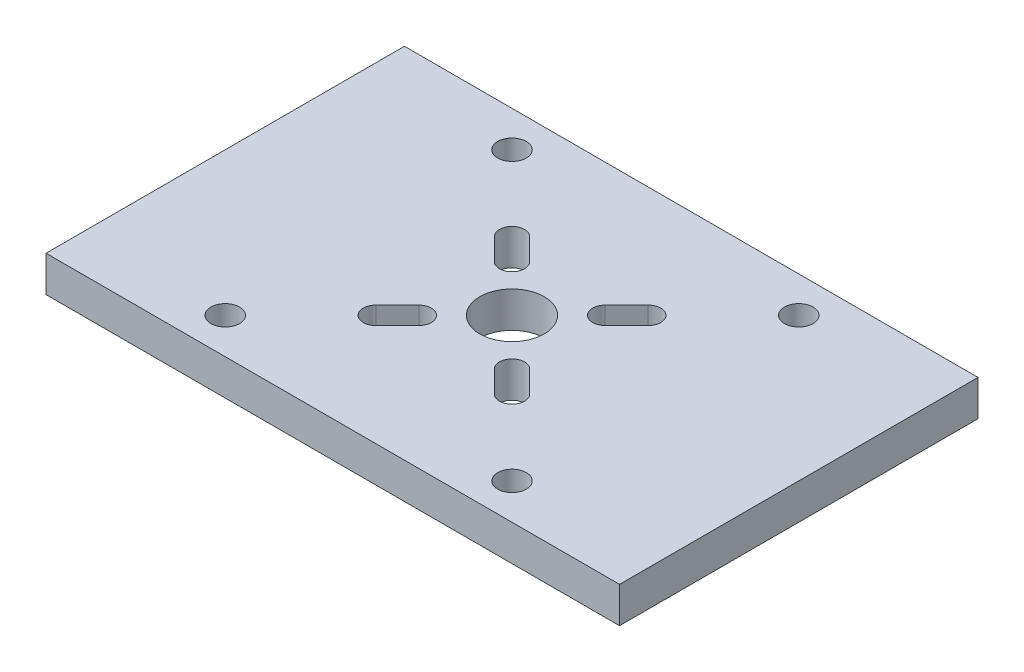
ISO-10303-21;
HEADER;
FILE_DESCRIPTION(('STEP AP214'),'2;1');
FILE_NAME('part.step','',(''),(''),'','','');
FILE_SCHEMA(('AUTOMOTIVE_DESIGN { 1 0 10303 214 1 1 1 1 }'));
ENDSEC;
DATA;
#1=APPLICATION_CONTEXT('core data for automotive mechanical design processes');
#2=APPLICATION_PROTOCOL_DEFINITION('international standard','automotive_design',2000,#1);
#3=PRODUCT_CONTEXT('',#1,'mechanical');
#4=PRODUCT('Part','Part','',(#3));
#5=PRODUCT_RELATED_PRODUCT_CATEGORY('part','',(#4));
#6=PRODUCT_DEFINITION_FORMATION('','',#4);
#7=PRODUCT_DEFINITION_CONTEXT('part definition',#1,'design');
#8=PRODUCT_DEFINITION('design','',#6,#7);
#9=PRODUCT_DEFINITION_SHAPE('','',#8);
#10=(LENGTH_UNIT() NAMED_UNIT(*) SI_UNIT(.MILLI.,.METRE.));
#11=(NAMED_UNIT(*) PLANE_ANGLE_UNIT() SI_UNIT($,.RADIAN.));
#12=(NAMED_UNIT(*) SI_UNIT($,.STERADIAN.) SOLID_ANGLE_UNIT());
#13=UNCERTAINTY_MEASURE_WITH_UNIT(LENGTH_MEASURE(1.E-05),#10,'distance_accuracy_value','');
#14=(GEOMETRIC_REPRESENTATION_CONTEXT(3) GLOBAL_UNCERTAINTY_ASSIGNED_CONTEXT((#13)) GLOBAL_UNIT_ASSIGNED_CONTEXT((#10,
#11,#12)) REPRESENTATION_CONTEXT('',''));
#15=CARTESIAN_POINT('',(0.,0.,0.));
#16=DIRECTION('',(0.,0.,1.));
#17=DIRECTION('',(1.,0.,0.));
#18=AXIS2_PLACEMENT_3D('',#15,#16,#17);
#19=CARTESIAN_POINT('',(0.,0.,0.));
#20=DIRECTION('',(0.,-1.,0.));
#21=DIRECTION('',(0.,0.,-1.));
#22=AXIS2_PLACEMENT_3D('',#19,#20,#21);
#23=PLANE('',#22);
#24=CARTESIAN_POINT('',(-40.,0.,-40.));
#25=DIRECTION('',(0.,-1.,0.));
#26=DIRECTION('',(0.,0.,-1.));
#27=AXIS2_PLACEMENT_3D('',#24,#25,#26);
#28=CIRCLE('',#27,4.);
#29=CARTESIAN_POINT('',(-40.,0.,-44.));
#30=VERTEX_POINT('',#29);
#31=EDGE_CURVE('E799',#30,#30,#28,.T.);
#32=ORIENTED_EDGE('',*,*,#31,.F.);
#33=EDGE_LOOP('',(#32));
#34=FACE_BOUND('',#33,.T.);
#35=CARTESIAN_POINT('',(40.,0.,-40.));
#36=DIRECTION('',(0.,-1.,0.));
#37=DIRECTION('',(0.,0.,-1.));
#38=AXIS2_PLACEMENT_3D('',#35,#36,#37);
#39=CIRCLE('',#38,4.);
#40=CARTESIAN_POINT('',(40.,0.,-44.));
#41=VERTEX_POINT('',#40);
#42=EDGE_CURVE('E803',#41,#41,#39,.T.);
#43=ORIENTED_EDGE('',*,*,#42,.F.);
#44=EDGE_LOOP('',(#43));
#45=FACE_BOUND('',#44,.T.);
#46=CARTESIAN_POINT('',(40.,0.,40.));
#47=DIRECTION('',(0.,-1.,0.));
#48=DIRECTION('',(0.,0.,-1.));
#49=AXIS2_PLACEMENT_3D('',#46,#47,#48);
#50=CIRCLE('',#49,4.);
#51=CARTESIAN_POINT('',(40.,0.,36.));
#52=VERTEX_POINT('',#51);
#53=EDGE_CURVE('E821',#52,#52,#50,.T.);
#54=ORIENTED_EDGE('',*,*,#53,.F.);
#55=EDGE_LOOP('',(#54));
#56=FACE_BOUND('',#55,.T.);
#57=CARTESIAN_POINT('',(-40.,0.,40.));
#58=DIRECTION('',(0.,-1.,0.));
#59=DIRECTION('',(0.,0.,-1.));
#60=AXIS2_PLACEMENT_3D('',#57,#58,#59);
#61=CIRCLE('',#60,4.);
#62=CARTESIAN_POINT('',(-40.,0.,36.));
#63=VERTEX_POINT('',#62);
#64=EDGE_CURVE('E810',#63,#63,#61,.T.);
#65=ORIENTED_EDGE('',*,*,#64,.F.);
#66=EDGE_LOOP('',(#65));
#67=FACE_BOUND('',#66,.T.);
#68=DIRECTION('',(0.707106781186549,0.,0.707106781186546));
#69=VECTOR('',#68,1.);
#70=CARTESIAN_POINT('',(-4.24264068711925,0.,4.24264068711926));
#71=LINE('',#70,#69);
#72=CARTESIAN_POINT('',(-23.2426406871193,0.,-14.7573593128807));
#73=VERTEX_POINT('',#72);
#74=CARTESIAN_POINT('',(-17.2426406871193,0.,-8.75735931288071));
#75=VERTEX_POINT('',#74);
#76=EDGE_CURVE('E497',#73,#75,#71,.T.);
#77=ORIENTED_EDGE('',*,*,#76,.T.);
#78=CARTESIAN_POINT('',(-13.,0.,-13.));
#79=DIRECTION('',(0.,-1.,0.));
#80=DIRECTION('',(0.,0.,-1.));
#81=AXIS2_PLACEMENT_3D('',#78,#79,#80);
#82=CIRCLE('',#81,6.);
#83=CARTESIAN_POINT('',(-8.75735931288069,0.,-17.2426406871193));
#84=VERTEX_POINT('',#83);
#85=EDGE_CURVE('E501',#75,#84,#82,.F.);
#86=ORIENTED_EDGE('',*,*,#85,.T.);
#87=DIRECTION('',(-0.707106781186548,0.,-0.707106781186548));
#88=VECTOR('',#87,1.);
#89=CARTESIAN_POINT('',(4.2426406871193,0.,-4.2426406871193));
#90=LINE('',#89,#88);
#91=CARTESIAN_POINT('',(-14.7573593128807,0.,-23.2426406871193));
#92=VERTEX_POINT('',#91);
#93=EDGE_CURVE('E489',#84,#92,#90,.T.);
#94=ORIENTED_EDGE('',*,*,#93,.T.);
#95=CARTESIAN_POINT('',(-19.,0.,-19.));
#96=DIRECTION('',(0.,-1.,0.));
#97=DIRECTION('',(0.,0.,-1.));
#98=AXIS2_PLACEMENT_3D('',#95,#96,#97);
#99=CIRCLE('',#98,6.00000000000001);
#100=EDGE_CURVE('E493',#92,#73,#99,.F.);
#101=ORIENTED_EDGE('',*,*,#100,.T.);
#102=EDGE_LOOP('',(#77,#86,#94,#101));
#103=FACE_BOUND('',#102,.T.);
#104=DIRECTION('',(0.707106781186548,0.,0.707106781186547));
#105=VECTOR('',#104,1.);
#106=CARTESIAN_POINT('',(-4.24264068711931,0.,4.24264068711931));
#107=LINE('',#106,#105);
#108=CARTESIAN_POINT('',(8.75735931288068,0.,17.2426406871193));
#109=VERTEX_POINT('',#108);
#110=CARTESIAN_POINT('',(14.7573593128807,0.,23.2426406871193));
#111=VERTEX_POINT('',#110);
#112=EDGE_CURVE('E467',#109,#111,#107,.T.);
#113=ORIENTED_EDGE('',*,*,#112,.T.);
#114=CARTESIAN_POINT('',(19.,0.,19.));
#115=DIRECTION('',(0.,-1.,0.));
#116=DIRECTION('',(0.,0.,-1.));
#117=AXIS2_PLACEMENT_3D('',#114,#115,#116);
#118=CIRCLE('',#117,6.);
#119=CARTESIAN_POINT('',(23.2426406871193,0.,14.7573593128807));
#120=VERTEX_POINT('',#119);
#121=EDGE_CURVE('E471',#111,#120,#118,.F.);
#122=ORIENTED_EDGE('',*,*,#121,.T.);
#123=DIRECTION('',(-0.707106781186548,0.,-0.707106781186548));
#124=VECTOR('',#123,1.);
#125=CARTESIAN_POINT('',(4.24264068711927,0.,-4.24264068711927));
#126=LINE('',#125,#124);
#127=CARTESIAN_POINT('',(17.2426406871193,0.,8.75735931288072));
#128=VERTEX_POINT('',#127);
#129=EDGE_CURVE('E447',#120,#128,#126,.T.);
#130=ORIENTED_EDGE('',*,*,#129,.T.);
#131=CARTESIAN_POINT('',(13.,0.,13.));
#132=DIRECTION('',(0.,-1.,0.));
#133=DIRECTION('',(0.,0.,-1.));
#134=AXIS2_PLACEMENT_3D('',#131,#132,#133);
#135=CIRCLE('',#134,6.00000000000001);
#136=EDGE_CURVE('E463',#128,#109,#135,.F.);
#137=ORIENTED_EDGE('',*,*,#136,.T.);
#138=EDGE_LOOP('',(#113,#122,#130,#137));
#139=FACE_BOUND('',#138,.T.);
#140=CARTESIAN_POINT('',(0.,0.,0.));
#141=DIRECTION('',(0.,-1.,0.));
#142=DIRECTION('',(0.,0.,-1.));
#143=AXIS2_PLACEMENT_3D('',#140,#141,#142);
#144=CIRCLE('',#143,9.);
#145=CARTESIAN_POINT('',(0.,0.,-9.));
#146=VERTEX_POINT('',#145);
#147=EDGE_CURVE('E413',#146,#146,#144,.T.);
#148=ORIENTED_EDGE('',*,*,#147,.F.);
#149=EDGE_LOOP('',(#148));
#150=FACE_BOUND('',#149,.T.);
#151=DIRECTION('',(0.,0.,1.));
#152=VECTOR('',#151,1.);
#153=CARTESIAN_POINT('',(80.,0.,-50.));
#154=LINE('',#153,#152);
#155=CARTESIAN_POINT('',(80.,0.,-50.));
#156=VERTEX_POINT('',#155);
#157=CARTESIAN_POINT('',(80.,0.,50.));
#158=VERTEX_POINT('',#157);
#159=EDGE_CURVE('E430',#156,#158,#154,.T.);
#160=ORIENTED_EDGE('',*,*,#159,.T.);
#161=DIRECTION('',(-1.,0.,0.));
#162=VECTOR('',#161,1.);
#163=CARTESIAN_POINT('',(80.,0.,50.));
#164=LINE('',#163,#162);
#165=CARTESIAN_POINT('',(-80.,0.,50.));
#166=VERTEX_POINT('',#165);
#167=EDGE_CURVE('E434',#158,#166,#164,.T.);
#168=ORIENTED_EDGE('',*,*,#167,.T.);
#169=DIRECTION('',(0.,0.,1.));
#170=VECTOR('',#169,1.);
#171=CARTESIAN_POINT('',(-80.,0.,-50.));
#172=LINE('',#171,#170);
#173=CARTESIAN_POINT('',(-80.,0.,-50.));
#174=VERTEX_POINT('',#173);
#175=EDGE_CURVE('E438',#174,#166,#172,.T.);
#176=ORIENTED_EDGE('',*,*,#175,.F.);
#177=DIRECTION('',(-1.,0.,0.));
#178=VECTOR('',#177,1.);
#179=CARTESIAN_POINT('',(80.,0.,-50.));
#180=LINE('',#179,#178);
#181=EDGE_CURVE('E419',#156,#174,#180,.T.);
#182=ORIENTED_EDGE('',*,*,#181,.F.);
#183=EDGE_LOOP('',(#160,#168,#176,#182));
#184=FACE_BOUND('',#183,.T.);
#185=DIRECTION('',(0.707106781186548,0.,-0.707106781186547));
#186=VECTOR('',#185,1.);
#187=CARTESIAN_POINT('',(4.24264068711932,0.,4.24264068711933));
#188=LINE('',#187,#186);
#189=CARTESIAN_POINT('',(-14.7573593128807,0.,23.2426406871193));
#190=VERTEX_POINT('',#189);
#191=CARTESIAN_POINT('',(-8.75735931288068,0.,17.2426406871193));
#192=VERTEX_POINT('',#191);
#193=EDGE_CURVE('E482',#190,#192,#188,.T.);
#194=ORIENTED_EDGE('',*,*,#193,.T.);
#195=CARTESIAN_POINT('',(-13.,0.,13.));
#196=DIRECTION('',(0.,-1.,0.));
#197=DIRECTION('',(0.,0.,-1.));
#198=AXIS2_PLACEMENT_3D('',#195,#196,#197);
#199=CIRCLE('',#198,6.00000000000001);
#200=CARTESIAN_POINT('',(-17.2426406871193,0.,8.75735931288071));
#201=VERTEX_POINT('',#200);
#202=EDGE_CURVE('E486',#192,#201,#199,.F.);
#203=ORIENTED_EDGE('',*,*,#202,.T.);
#204=DIRECTION('',(-0.707106781186547,0.,0.707106781186548));
#205=VECTOR('',#204,1.);
#206=CARTESIAN_POINT('',(-4.24264068711928,0.,-4.24264068711928));
#207=LINE('',#206,#205);
#208=CARTESIAN_POINT('',(-23.2426406871193,0.,14.7573593128807));
#209=VERTEX_POINT('',#208);
#210=EDGE_CURVE('E474',#201,#209,#207,.T.);
#211=ORIENTED_EDGE('',*,*,#210,.T.);
#212=CARTESIAN_POINT('',(-19.,0.,19.));
#213=DIRECTION('',(0.,-1.,0.));
#214=DIRECTION('',(0.,0.,-1.));
#215=AXIS2_PLACEMENT_3D('',#212,#213,#214);
#216=CIRCLE('',#215,6.);
#217=EDGE_CURVE('E478',#209,#190,#216,.F.);
#218=ORIENTED_EDGE('',*,*,#217,.T.);
#219=EDGE_LOOP('',(#194,#203,#211,#218));
#220=FACE_BOUND('',#219,.T.);
#221=DIRECTION('',(0.707106781186548,0.,-0.707106781186547));
#222=VECTOR('',#221,1.);
#223=CARTESIAN_POINT('',(4.24264068711927,0.,4.24264068711927));
#224=LINE('',#223,#222);
#225=CARTESIAN_POINT('',(17.2426406871193,0.,-8.75735931288072));
#226=VERTEX_POINT('',#225);
#227=CARTESIAN_POINT('',(23.2426406871193,0.,-14.7573593128807));
#228=VERTEX_POINT('',#227);
#229=EDGE_CURVE('E52',#226,#228,#224,.T.);
#230=ORIENTED_EDGE('',*,*,#229,.T.);
#231=CARTESIAN_POINT('',(19.,0.,-19.));
#232=DIRECTION('',(0.,-1.,0.));
#233=DIRECTION('',(0.,0.,-1.));
#234=AXIS2_PLACEMENT_3D('',#231,#232,#233);
#235=CIRCLE('',#234,6.00000000000001);
#236=CARTESIAN_POINT('',(14.7573593128807,0.,-23.2426406871193));
#237=VERTEX_POINT('',#236);
#238=EDGE_CURVE('E11',#228,#237,#235,.F.);
#239=ORIENTED_EDGE('',*,*,#238,.T.);
#240=DIRECTION('',(-0.707106781186547,0.,0.707106781186548));
#241=VECTOR('',#240,1.);
#242=CARTESIAN_POINT('',(-4.2426406871193,0.,-4.2426406871193));
#243=LINE('',#242,#241);
#244=CARTESIAN_POINT('',(8.75735931288068,0.,-17.2426406871193));
#245=VERTEX_POINT('',#244);
#246=EDGE_CURVE('E504',#237,#245,#243,.T.);
#247=ORIENTED_EDGE('',*,*,#246,.T.);
#248=CARTESIAN_POINT('',(13.,0.,-13.));
#249=DIRECTION('',(0.,-1.,0.));
#250=DIRECTION('',(0.,0.,-1.));
#251=AXIS2_PLACEMENT_3D('',#248,#249,#250);
#252=CIRCLE('',#251,6.00000000000001);
#253=EDGE_CURVE('E508',#245,#226,#252,.F.);
#254=ORIENTED_EDGE('',*,*,#253,.T.);
#255=EDGE_LOOP('',(#230,#239,#247,#254));
#256=FACE_BOUND('',#255,.T.);
#257=ADVANCED_FACE('F43',(#34,#45,#56,#67,#103,#139,#150,#184,#220,#256),#23,.T.);
#258=ORIENTED_EDGE('',*,*,#238,.F.);
#259=ORIENTED_EDGE('',*,*,#229,.F.);
#260=ORIENTED_EDGE('',*,*,#253,.F.);
#261=ORIENTED_EDGE('',*,*,#246,.F.);
#262=EDGE_LOOP('',(#258,#259,#260,#261));
#263=FACE_BOUND('',#262,.T.);
#264=CARTESIAN_POINT('',(19.,0.,-19.));
#265=DIRECTION('',(0.,-1.,0.));
#266=DIRECTION('',(0.,0.,-1.));
#267=AXIS2_PLACEMENT_3D('',#264,#265,#266);
#268=CIRCLE('',#267,3.50000000000001);
#269=CARTESIAN_POINT('',(21.4748737341529,0.,-16.5251262658471));
#270=VERTEX_POINT('',#269);
#271=CARTESIAN_POINT('',(16.5251262658471,0.,-21.4748737341529));
#272=VERTEX_POINT('',#271);
#273=EDGE_CURVE('E286',#270,#272,#268,.F.);
#274=ORIENTED_EDGE('',*,*,#273,.T.);
#275=DIRECTION('',(-0.707106781186547,0.,0.707106781186548));
#276=VECTOR('',#275,1.);
#277=CARTESIAN_POINT('',(16.5251262658471,0.,-21.4748737341529));
#278=LINE('',#277,#276);
#279=CARTESIAN_POINT('',(10.5251262658471,0.,-15.4748737341529));
#280=VERTEX_POINT('',#279);
#281=EDGE_CURVE('E309',#272,#280,#278,.T.);
#282=ORIENTED_EDGE('',*,*,#281,.T.);
#283=CARTESIAN_POINT('',(13.,0.,-13.));
#284=DIRECTION('',(0.,-1.,0.));
#285=DIRECTION('',(0.,0.,-1.));
#286=AXIS2_PLACEMENT_3D('',#283,#284,#285);
#287=CIRCLE('',#286,3.5);
#288=CARTESIAN_POINT('',(15.4748737341529,0.,-10.5251262658471));
#289=VERTEX_POINT('',#288);
#290=EDGE_CURVE('E277',#280,#289,#287,.F.);
#291=ORIENTED_EDGE('',*,*,#290,.T.);
#292=DIRECTION('',(0.707106781186547,0.,-0.707106781186548));
#293=VECTOR('',#292,1.);
#294=CARTESIAN_POINT('',(21.4748737341529,0.,-16.5251262658471));
#295=LINE('',#294,#293);
#296=EDGE_CURVE('E281',#289,#270,#295,.T.);
#297=ORIENTED_EDGE('',*,*,#296,.T.);
#298=EDGE_LOOP('',(#274,#282,#291,#297));
#299=FACE_BOUND('',#298,.T.);
#300=ADVANCED_FACE('F513',(#263,#299),#23,.T.);
#301=ORIENTED_EDGE('',*,*,#85,.F.);
#302=ORIENTED_EDGE('',*,*,#76,.F.);
#303=ORIENTED_EDGE('',*,*,#100,.F.);
#304=ORIENTED_EDGE('',*,*,#93,.F.);
#305=EDGE_LOOP('',(#301,#302,#303,#304));
#306=FACE_BOUND('',#305,.T.);
#307=CARTESIAN_POINT('',(-19.,0.,-19.));
#308=DIRECTION('',(0.,-1.,0.));
#309=DIRECTION('',(0.,0.,-1.));
#310=AXIS2_PLACEMENT_3D('',#307,#308,#309);
#311=CIRCLE('',#310,3.50000000000001);
#312=CARTESIAN_POINT('',(-16.5251262658471,0.,-21.4748737341529));
#313=VERTEX_POINT('',#312);
#314=CARTESIAN_POINT('',(-21.4748737341529,0.,-16.5251262658471));
#315=VERTEX_POINT('',#314);
#316=EDGE_CURVE('E331',#313,#315,#311,.F.);
#317=ORIENTED_EDGE('',*,*,#316,.T.);
#318=DIRECTION('',(0.707106781186547,0.,0.707106781186548));
#319=VECTOR('',#318,1.);
#320=CARTESIAN_POINT('',(-21.4748737341529,0.,-16.5251262658471));
#321=LINE('',#320,#319);
#322=CARTESIAN_POINT('',(-15.4748737341529,0.,-10.5251262658471));
#323=VERTEX_POINT('',#322);
#324=EDGE_CURVE('E282',#315,#323,#321,.T.);
#325=ORIENTED_EDGE('',*,*,#324,.T.);
#326=CARTESIAN_POINT('',(-13.,0.,-13.));
#327=DIRECTION('',(0.,-1.,0.));
#328=DIRECTION('',(0.,0.,-1.));
#329=AXIS2_PLACEMENT_3D('',#326,#327,#328);
#330=CIRCLE('',#329,3.5);
#331=CARTESIAN_POINT('',(-10.5251262658471,0.,-15.4748737341529));
#332=VERTEX_POINT('',#331);
#333=EDGE_CURVE('E322',#323,#332,#330,.F.);
#334=ORIENTED_EDGE('',*,*,#333,.T.);
#335=DIRECTION('',(-0.707106781186547,0.,-0.707106781186548));
#336=VECTOR('',#335,1.);
#337=CARTESIAN_POINT('',(-16.5251262658471,0.,-21.4748737341529));
#338=LINE('',#337,#336);
#339=EDGE_CURVE('E326',#332,#313,#338,.T.);
#340=ORIENTED_EDGE('',*,*,#339,.T.);
#341=EDGE_LOOP('',(#317,#325,#334,#340));
#342=FACE_BOUND('',#341,.T.);
#343=ADVANCED_FACE('F516',(#306,#342),#23,.T.);
#344=ORIENTED_EDGE('',*,*,#202,.F.);
#345=ORIENTED_EDGE('',*,*,#193,.F.);
#346=ORIENTED_EDGE('',*,*,#217,.F.);
#347=ORIENTED_EDGE('',*,*,#210,.F.);
#348=EDGE_LOOP('',(#344,#345,#346,#347));
#349=FACE_BOUND('',#348,.T.);
#350=CARTESIAN_POINT('',(-19.,0.,19.));
#351=DIRECTION('',(0.,-1.,0.));
#352=DIRECTION('',(0.,0.,-1.));
#353=AXIS2_PLACEMENT_3D('',#350,#351,#352);
#354=CIRCLE('',#353,3.50000000000001);
#355=CARTESIAN_POINT('',(-21.4748737341529,0.,16.5251262658471));
#356=VERTEX_POINT('',#355);
#357=CARTESIAN_POINT('',(-16.5251262658471,0.,21.4748737341529));
#358=VERTEX_POINT('',#357);
#359=EDGE_CURVE('E373',#356,#358,#354,.F.);
#360=ORIENTED_EDGE('',*,*,#359,.T.);
#361=DIRECTION('',(0.707106781186547,0.,-0.707106781186548));
#362=VECTOR('',#361,1.);
#363=CARTESIAN_POINT('',(-16.5251262658471,0.,21.4748737341529));
#364=LINE('',#363,#362);
#365=CARTESIAN_POINT('',(-10.5251262658471,0.,15.4748737341529));
#366=VERTEX_POINT('',#365);
#367=EDGE_CURVE('E396',#358,#366,#364,.T.);
#368=ORIENTED_EDGE('',*,*,#367,.T.);
#369=CARTESIAN_POINT('',(-13.,0.,13.));
#370=DIRECTION('',(0.,-1.,0.));
#371=DIRECTION('',(0.,0.,-1.));
#372=AXIS2_PLACEMENT_3D('',#369,#370,#371);
#373=CIRCLE('',#372,3.5);
#374=CARTESIAN_POINT('',(-15.4748737341529,0.,10.5251262658471));
#375=VERTEX_POINT('',#374);
#376=EDGE_CURVE('E236',#366,#375,#373,.F.);
#377=ORIENTED_EDGE('',*,*,#376,.T.);
#378=DIRECTION('',(-0.707106781186547,0.,0.707106781186548));
#379=VECTOR('',#378,1.);
#380=CARTESIAN_POINT('',(-21.4748737341529,0.,16.5251262658471));
#381=LINE('',#380,#379);
#382=EDGE_CURVE('E369',#375,#356,#381,.T.);
#383=ORIENTED_EDGE('',*,*,#382,.T.);
#384=EDGE_LOOP('',(#360,#368,#377,#383));
#385=FACE_BOUND('',#384,.T.);
#386=ADVANCED_FACE('F559',(#349,#385),#23,.T.);
#387=CARTESIAN_POINT('',(80.,10.,-50.));
#388=DIRECTION('',(1.,0.,0.));
#389=DIRECTION('',(0.,0.,-1.));
#390=AXIS2_PLACEMENT_3D('',#387,#388,#389);
#391=PLANE('',#390);
#392=ORIENTED_EDGE('',*,*,#159,.F.);
#393=DIRECTION('',(0.,-1.,0.));
#394=VECTOR('',#393,1.);
#395=CARTESIAN_POINT('',(80.,10.,-50.));
#396=LINE('',#395,#394);
#397=CARTESIAN_POINT('',(80.,10.,-50.));
#398=VERTEX_POINT('',#397);
#399=EDGE_CURVE('E444',#398,#156,#396,.T.);
#400=ORIENTED_EDGE('',*,*,#399,.F.);
#401=DIRECTION('',(0.,0.,1.));
#402=VECTOR('',#401,1.);
#403=CARTESIAN_POINT('',(80.,10.,-50.));
#404=LINE('',#403,#402);
#405=CARTESIAN_POINT('',(80.,10.,50.));
#406=VERTEX_POINT('',#405);
#407=EDGE_CURVE('E414',#398,#406,#404,.T.);
#408=ORIENTED_EDGE('',*,*,#407,.T.);
#409=DIRECTION('',(0.,-1.,0.));
#410=VECTOR('',#409,1.);
#411=CARTESIAN_POINT('',(80.,10.,50.));
#412=LINE('',#411,#410);
#413=EDGE_CURVE('E429',#406,#158,#412,.T.);
#414=ORIENTED_EDGE('',*,*,#413,.T.);
#415=EDGE_LOOP('',(#392,#400,#408,#414));
#416=FACE_BOUND('',#415,.T.);
#417=ADVANCED_FACE('F45',(#416),#391,.T.);
#418=CARTESIAN_POINT('',(80.,10.,-50.));
#419=DIRECTION('',(0.,0.,1.));
#420=DIRECTION('',(1.,0.,0.));
#421=AXIS2_PLACEMENT_3D('',#418,#419,#420);
#422=PLANE('',#421);
#423=ORIENTED_EDGE('',*,*,#181,.T.);
#424=DIRECTION('',(0.,-1.,0.));
#425=VECTOR('',#424,1.);
#426=CARTESIAN_POINT('',(-80.,10.,-50.));
#427=LINE('',#426,#425);
#428=CARTESIAN_POINT('',(-80.,10.,-50.));
#429=VERTEX_POINT('',#428);
#430=EDGE_CURVE('E448',#429,#174,#427,.T.);
#431=ORIENTED_EDGE('',*,*,#430,.F.);
#432=DIRECTION('',(-1.,0.,0.));
#433=VECTOR('',#432,1.);
#434=CARTESIAN_POINT('',(80.,10.,-50.));
#435=LINE('',#434,#433);
#436=EDGE_CURVE('E426',#398,#429,#435,.T.);
#437=ORIENTED_EDGE('',*,*,#436,.F.);
#438=ORIENTED_EDGE('',*,*,#399,.T.);
#439=EDGE_LOOP('',(#423,#431,#437,#438));
#440=FACE_BOUND('',#439,.T.);
#441=ADVANCED_FACE('F574',(#440),#422,.F.);
#442=CARTESIAN_POINT('',(-80.,10.,-50.));
#443=DIRECTION('',(1.,0.,0.));
#444=DIRECTION('',(0.,0.,-1.));
#445=AXIS2_PLACEMENT_3D('',#442,#443,#444);
#446=PLANE('',#445);
#447=ORIENTED_EDGE('',*,*,#175,.T.);
#448=DIRECTION('',(0.,-1.,0.));
#449=VECTOR('',#448,1.);
#450=CARTESIAN_POINT('',(-80.,10.,50.));
#451=LINE('',#450,#449);
#452=CARTESIAN_POINT('',(-80.,10.,50.));
#453=VERTEX_POINT('',#452);
#454=EDGE_CURVE('E452',#453,#166,#451,.T.);
#455=ORIENTED_EDGE('',*,*,#454,.F.);
#456=DIRECTION('',(0.,0.,1.));
#457=VECTOR('',#456,1.);
#458=CARTESIAN_POINT('',(-80.,10.,-50.));
#459=LINE('',#458,#457);
#460=EDGE_CURVE('E423',#429,#453,#459,.T.);
#461=ORIENTED_EDGE('',*,*,#460,.F.);
#462=ORIENTED_EDGE('',*,*,#430,.T.);
#463=EDGE_LOOP('',(#447,#455,#461,#462));
#464=FACE_BOUND('',#463,.T.);
#465=ADVANCED_FACE('F854',(#464),#446,.F.);
#466=CARTESIAN_POINT('',(80.,10.,50.));
#467=DIRECTION('',(0.,0.,1.));
#468=DIRECTION('',(1.,0.,0.));
#469=AXIS2_PLACEMENT_3D('',#466,#467,#468);
#470=PLANE('',#469);
#471=ORIENTED_EDGE('',*,*,#167,.F.);
#472=ORIENTED_EDGE('',*,*,#413,.F.);
#473=DIRECTION('',(-1.,0.,0.));
#474=VECTOR('',#473,1.);
#475=CARTESIAN_POINT('',(80.,10.,50.));
#476=LINE('',#475,#474);
#477=EDGE_CURVE('E418',#406,#453,#476,.T.);
#478=ORIENTED_EDGE('',*,*,#477,.T.);
#479=ORIENTED_EDGE('',*,*,#454,.T.);
#480=EDGE_LOOP('',(#471,#472,#478,#479));
#481=FACE_BOUND('',#480,.T.);
#482=ADVANCED_FACE('F566',(#481),#470,.T.);
#483=CARTESIAN_POINT('',(0.,10.,0.));
#484=DIRECTION('',(0.,-1.,0.));
#485=DIRECTION('',(0.,0.,-1.));
#486=AXIS2_PLACEMENT_3D('',#483,#484,#485);
#487=PLANE('',#486);
#488=CARTESIAN_POINT('',(-40.,10.,-40.));
#489=DIRECTION('',(0.,-1.,0.));
#490=DIRECTION('',(0.,0.,-1.));
#491=AXIS2_PLACEMENT_3D('',#488,#489,#490);
#492=CIRCLE('',#491,4.);
#493=CARTESIAN_POINT('',(-40.,10.,-44.));
#494=VERTEX_POINT('',#493);
#495=EDGE_CURVE('E797',#494,#494,#492,.T.);
#496=ORIENTED_EDGE('',*,*,#495,.T.);
#497=EDGE_LOOP('',(#496));
#498=FACE_BOUND('',#497,.T.);
#499=CARTESIAN_POINT('',(40.,10.,-40.));
#500=DIRECTION('',(0.,-1.,0.));
#501=DIRECTION('',(0.,0.,-1.));
#502=AXIS2_PLACEMENT_3D('',#499,#500,#501);
#503=CIRCLE('',#502,4.);
#504=CARTESIAN_POINT('',(40.,10.,-44.));
#505=VERTEX_POINT('',#504);
#506=EDGE_CURVE('E825',#505,#505,#503,.T.);
#507=ORIENTED_EDGE('',*,*,#506,.T.);
#508=EDGE_LOOP('',(#507));
#509=FACE_BOUND('',#508,.T.);
#510=CARTESIAN_POINT('',(40.,10.,40.));
#511=DIRECTION('',(0.,-1.,0.));
#512=DIRECTION('',(0.,0.,-1.));
#513=AXIS2_PLACEMENT_3D('',#510,#511,#512);
#514=CIRCLE('',#513,4.);
#515=CARTESIAN_POINT('',(40.,10.,36.));
#516=VERTEX_POINT('',#515);
#517=EDGE_CURVE('E813',#516,#516,#514,.T.);
#518=ORIENTED_EDGE('',*,*,#517,.T.);
#519=EDGE_LOOP('',(#518));
#520=FACE_BOUND('',#519,.T.);
#521=CARTESIAN_POINT('',(-40.,10.,40.));
#522=DIRECTION('',(0.,-1.,0.));
#523=DIRECTION('',(0.,0.,-1.));
#524=AXIS2_PLACEMENT_3D('',#521,#522,#523);
#525=CIRCLE('',#524,4.);
#526=CARTESIAN_POINT('',(-40.,10.,36.));
#527=VERTEX_POINT('',#526);
#528=EDGE_CURVE('E327',#527,#527,#525,.T.);
#529=ORIENTED_EDGE('',*,*,#528,.T.);
#530=EDGE_LOOP('',(#529));
#531=FACE_BOUND('',#530,.T.);
#532=DIRECTION('',(0.707106781186547,0.,0.707106781186548));
#533=VECTOR('',#532,1.);
#534=CARTESIAN_POINT('',(-21.4748737341529,10.,-16.5251262658471));
#535=LINE('',#534,#533);
#536=CARTESIAN_POINT('',(-21.4748737341529,10.,-16.5251262658471));
#537=VERTEX_POINT('',#536);
#538=CARTESIAN_POINT('',(-15.4748737341529,10.,-10.5251262658471));
#539=VERTEX_POINT('',#538);
#540=EDGE_CURVE('E338',#537,#539,#535,.T.);
#541=ORIENTED_EDGE('',*,*,#540,.F.);
#542=CARTESIAN_POINT('',(-19.,10.,-19.));
#543=DIRECTION('',(0.,1.,0.));
#544=DIRECTION('',(0.,0.,-1.));
#545=AXIS2_PLACEMENT_3D('',#542,#543,#544);
#546=CIRCLE('',#545,3.50000000000001);
#547=CARTESIAN_POINT('',(-16.5251262658471,10.,-21.4748737341529));
#548=VERTEX_POINT('',#547);
#549=EDGE_CURVE('E335',#548,#537,#546,.T.);
#550=ORIENTED_EDGE('',*,*,#549,.F.);
#551=DIRECTION('',(-0.707106781186547,0.,-0.707106781186548));
#552=VECTOR('',#551,1.);
#553=CARTESIAN_POINT('',(-16.5251262658471,10.,-21.4748737341529));
#554=LINE('',#553,#552);
#555=CARTESIAN_POINT('',(-10.5251262658471,10.,-15.4748737341529));
#556=VERTEX_POINT('',#555);
#557=EDGE_CURVE('E346',#556,#548,#554,.T.);
#558=ORIENTED_EDGE('',*,*,#557,.F.);
#559=CARTESIAN_POINT('',(-13.,10.,-13.));
#560=DIRECTION('',(0.,1.,0.));
#561=DIRECTION('',(0.,0.,-1.));
#562=AXIS2_PLACEMENT_3D('',#559,#560,#561);
#563=CIRCLE('',#562,3.5);
#564=EDGE_CURVE('E342',#539,#556,#563,.T.);
#565=ORIENTED_EDGE('',*,*,#564,.F.);
#566=EDGE_LOOP('',(#541,#550,#558,#565));
#567=FACE_BOUND('',#566,.T.);
#568=DIRECTION('',(-0.707106781186547,0.,0.707106781186548));
#569=VECTOR('',#568,1.);
#570=CARTESIAN_POINT('',(16.5251262658471,10.,-21.4748737341529));
#571=LINE('',#570,#569);
#572=CARTESIAN_POINT('',(16.5251262658471,10.,-21.4748737341529));
#573=VERTEX_POINT('',#572);
#574=CARTESIAN_POINT('',(10.5251262658471,10.,-15.4748737341529));
#575=VERTEX_POINT('',#574);
#576=EDGE_CURVE('E293',#573,#575,#571,.T.);
#577=ORIENTED_EDGE('',*,*,#576,.F.);
#578=CARTESIAN_POINT('',(19.,10.,-19.));
#579=DIRECTION('',(0.,1.,0.));
#580=DIRECTION('',(0.,0.,1.));
#581=AXIS2_PLACEMENT_3D('',#578,#579,#580);
#582=CIRCLE('',#581,3.50000000000001);
#583=CARTESIAN_POINT('',(21.4748737341529,10.,-16.5251262658471));
#584=VERTEX_POINT('',#583);
#585=EDGE_CURVE('E290',#584,#573,#582,.T.);
#586=ORIENTED_EDGE('',*,*,#585,.F.);
#587=DIRECTION('',(0.707106781186547,0.,-0.707106781186548));
#588=VECTOR('',#587,1.);
#589=CARTESIAN_POINT('',(21.4748737341529,10.,-16.5251262658471));
#590=LINE('',#589,#588);
#591=CARTESIAN_POINT('',(15.4748737341529,10.,-10.5251262658471));
#592=VERTEX_POINT('',#591);
#593=EDGE_CURVE('E301',#592,#584,#590,.T.);
#594=ORIENTED_EDGE('',*,*,#593,.F.);
#595=CARTESIAN_POINT('',(13.,10.,-13.));
#596=DIRECTION('',(0.,1.,0.));
#597=DIRECTION('',(0.,0.,1.));
#598=AXIS2_PLACEMENT_3D('',#595,#596,#597);
#599=CIRCLE('',#598,3.5);
#600=EDGE_CURVE('E297',#575,#592,#599,.T.);
#601=ORIENTED_EDGE('',*,*,#600,.F.);
#602=EDGE_LOOP('',(#577,#586,#594,#601));
#603=FACE_BOUND('',#602,.T.);
#604=DIRECTION('',(-0.707106781186547,0.,-0.707106781186548));
#605=VECTOR('',#604,1.);
#606=CARTESIAN_POINT('',(21.4748737341529,10.,16.5251262658471));
#607=LINE('',#606,#605);
#608=CARTESIAN_POINT('',(21.4748737341529,10.,16.5251262658471));
#609=VERTEX_POINT('',#608);
#610=CARTESIAN_POINT('',(15.4748737341529,10.,10.5251262658471));
#611=VERTEX_POINT('',#610);
#612=EDGE_CURVE('E255',#609,#611,#607,.T.);
#613=ORIENTED_EDGE('',*,*,#612,.F.);
#614=CARTESIAN_POINT('',(19.,10.,19.));
#615=DIRECTION('',(0.,1.,0.));
#616=DIRECTION('',(0.,0.,-1.));
#617=AXIS2_PLACEMENT_3D('',#614,#615,#616);
#618=CIRCLE('',#617,3.50000000000001);
#619=CARTESIAN_POINT('',(16.5251262658471,10.,21.4748737341529));
#620=VERTEX_POINT('',#619);
#621=EDGE_CURVE('E244',#620,#609,#618,.T.);
#622=ORIENTED_EDGE('',*,*,#621,.F.);
#623=DIRECTION('',(0.707106781186547,0.,0.707106781186548));
#624=VECTOR('',#623,1.);
#625=CARTESIAN_POINT('',(16.5251262658471,10.,21.4748737341529));
#626=LINE('',#625,#624);
#627=CARTESIAN_POINT('',(10.5251262658471,10.,15.4748737341529));
#628=VERTEX_POINT('',#627);
#629=EDGE_CURVE('E246',#628,#620,#626,.T.);
#630=ORIENTED_EDGE('',*,*,#629,.F.);
#631=CARTESIAN_POINT('',(13.,10.,13.));
#632=DIRECTION('',(0.,1.,0.));
#633=DIRECTION('',(0.,0.,-1.));
#634=AXIS2_PLACEMENT_3D('',#631,#632,#633);
#635=CIRCLE('',#634,3.5);
#636=EDGE_CURVE('E263',#611,#628,#635,.T.);
#637=ORIENTED_EDGE('',*,*,#636,.F.);
#638=EDGE_LOOP('',(#613,#622,#630,#637));
#639=FACE_BOUND('',#638,.T.);
#640=DIRECTION('',(0.707106781186547,0.,-0.707106781186548));
#641=VECTOR('',#640,1.);
#642=CARTESIAN_POINT('',(-16.5251262658471,10.,21.4748737341529));
#643=LINE('',#642,#641);
#644=CARTESIAN_POINT('',(-16.5251262658471,10.,21.4748737341529));
#645=VERTEX_POINT('',#644);
#646=CARTESIAN_POINT('',(-10.5251262658471,10.,15.4748737341529));
#647=VERTEX_POINT('',#646);
#648=EDGE_CURVE('E380',#645,#647,#643,.T.);
#649=ORIENTED_EDGE('',*,*,#648,.F.);
#650=CARTESIAN_POINT('',(-19.,10.,19.));
#651=DIRECTION('',(0.,1.,0.));
#652=DIRECTION('',(0.,0.,1.));
#653=AXIS2_PLACEMENT_3D('',#650,#651,#652);
#654=CIRCLE('',#653,3.50000000000001);
#655=CARTESIAN_POINT('',(-21.4748737341529,10.,16.5251262658471));
#656=VERTEX_POINT('',#655);
#657=EDGE_CURVE('E377',#656,#645,#654,.T.);
#658=ORIENTED_EDGE('',*,*,#657,.F.);
#659=DIRECTION('',(-0.707106781186547,0.,0.707106781186548));
#660=VECTOR('',#659,1.);
#661=CARTESIAN_POINT('',(-21.4748737341529,10.,16.5251262658471));
#662=LINE('',#661,#660);
#663=CARTESIAN_POINT('',(-15.4748737341529,10.,10.5251262658471));
#664=VERTEX_POINT('',#663);
#665=EDGE_CURVE('E388',#664,#656,#662,.T.);
#666=ORIENTED_EDGE('',*,*,#665,.F.);
#667=CARTESIAN_POINT('',(-13.,10.,13.));
#668=DIRECTION('',(0.,1.,0.));
#669=DIRECTION('',(0.,0.,1.));
#670=AXIS2_PLACEMENT_3D('',#667,#668,#669);
#671=CIRCLE('',#670,3.5);
#672=EDGE_CURVE('E384',#647,#664,#671,.T.);
#673=ORIENTED_EDGE('',*,*,#672,.F.);
#674=EDGE_LOOP('',(#649,#658,#666,#673));
#675=FACE_BOUND('',#674,.T.);
#676=CARTESIAN_POINT('',(0.,10.,0.));
#677=DIRECTION('',(0.,1.,0.));
#678=DIRECTION('',(0.,0.,1.));
#679=AXIS2_PLACEMENT_3D('',#676,#677,#678);
#680=CIRCLE('',#679,9.);
#681=CARTESIAN_POINT('',(0.,10.,9.));
#682=VERTEX_POINT('',#681);
#683=EDGE_CURVE('E409',#682,#682,#680,.T.);
#684=ORIENTED_EDGE('',*,*,#683,.F.);
#685=EDGE_LOOP('',(#684));
#686=FACE_BOUND('',#685,.T.);
#687=ORIENTED_EDGE('',*,*,#407,.F.);
#688=ORIENTED_EDGE('',*,*,#436,.T.);
#689=ORIENTED_EDGE('',*,*,#460,.T.);
#690=ORIENTED_EDGE('',*,*,#477,.F.);
#691=EDGE_LOOP('',(#687,#688,#689,#690));
#692=FACE_BOUND('',#691,.T.);
#693=ADVANCED_FACE('F530',(#498,#509,#520,#531,#567,#603,#639,#675,#686,#692),#487,.F.);
#694=ORIENTED_EDGE('',*,*,#121,.F.);
#695=ORIENTED_EDGE('',*,*,#112,.F.);
#696=ORIENTED_EDGE('',*,*,#136,.F.);
#697=ORIENTED_EDGE('',*,*,#129,.F.);
#698=EDGE_LOOP('',(#694,#695,#696,#697));
#699=FACE_BOUND('',#698,.T.);
#700=CARTESIAN_POINT('',(19.,0.,19.));
#701=DIRECTION('',(0.,-1.,0.));
#702=DIRECTION('',(0.,0.,-1.));
#703=AXIS2_PLACEMENT_3D('',#700,#701,#702);
#704=CIRCLE('',#703,3.50000000000001);
#705=CARTESIAN_POINT('',(16.5251262658471,0.,21.4748737341529));
#706=VERTEX_POINT('',#705);
#707=CARTESIAN_POINT('',(21.4748737341529,0.,16.5251262658471));
#708=VERTEX_POINT('',#707);
#709=EDGE_CURVE('E241',#706,#708,#704,.F.);
#710=ORIENTED_EDGE('',*,*,#709,.T.);
#711=DIRECTION('',(-0.707106781186547,0.,-0.707106781186548));
#712=VECTOR('',#711,1.);
#713=CARTESIAN_POINT('',(21.4748737341529,0.,16.5251262658471));
#714=LINE('',#713,#712);
#715=CARTESIAN_POINT('',(15.4748737341529,0.,10.5251262658471));
#716=VERTEX_POINT('',#715);
#717=EDGE_CURVE('E224',#708,#716,#714,.T.);
#718=ORIENTED_EDGE('',*,*,#717,.T.);
#719=CARTESIAN_POINT('',(13.,0.,13.));
#720=DIRECTION('',(0.,-1.,0.));
#721=DIRECTION('',(0.,0.,-1.));
#722=AXIS2_PLACEMENT_3D('',#719,#720,#721);
#723=CIRCLE('',#722,3.5);
#724=CARTESIAN_POINT('',(10.5251262658471,0.,15.4748737341529));
#725=VERTEX_POINT('',#724);
#726=EDGE_CURVE('E257',#716,#725,#723,.F.);
#727=ORIENTED_EDGE('',*,*,#726,.T.);
#728=DIRECTION('',(0.707106781186547,0.,0.707106781186548));
#729=VECTOR('',#728,1.);
#730=CARTESIAN_POINT('',(16.5251262658471,0.,21.4748737341529));
#731=LINE('',#730,#729);
#732=EDGE_CURVE('E250',#725,#706,#731,.T.);
#733=ORIENTED_EDGE('',*,*,#732,.T.);
#734=EDGE_LOOP('',(#710,#718,#727,#733));
#735=FACE_BOUND('',#734,.T.);
#736=ADVANCED_FACE('F249',(#699,#735),#23,.T.);
#737=CARTESIAN_POINT('',(0.,-30.,0.));
#738=DIRECTION('',(0.,1.,0.));
#739=DIRECTION('',(0.,0.,1.));
#740=AXIS2_PLACEMENT_3D('',#737,#738,#739);
#741=CYLINDRICAL_SURFACE('',#740,9.);
#742=ORIENTED_EDGE('',*,*,#147,.T.);
#743=EDGE_LOOP('',(#742));
#744=FACE_BOUND('',#743,.T.);
#745=ORIENTED_EDGE('',*,*,#683,.T.);
#746=EDGE_LOOP('',(#745));
#747=FACE_BOUND('',#746,.T.);
#748=ADVANCED_FACE('F557',(#744,#747),#741,.F.);
#749=CARTESIAN_POINT('',(-19.,-0.000999999999999265,19.));
#750=DIRECTION('',(0.,1.,0.));
#751=DIRECTION('',(0.,0.,1.));
#752=AXIS2_PLACEMENT_3D('',#749,#750,#751);
#753=CYLINDRICAL_SURFACE('',#752,3.50000000000001);
#754=DIRECTION('',(0.,1.,0.));
#755=VECTOR('',#754,1.);
#756=CARTESIAN_POINT('',(-21.4748737341529,-0.000999999999999265,16.5251262658471));
#757=LINE('',#756,#755);
#758=EDGE_CURVE('E393',#356,#656,#757,.T.);
#759=ORIENTED_EDGE('',*,*,#758,.T.);
#760=ORIENTED_EDGE('',*,*,#657,.T.);
#761=DIRECTION('',(0.,1.,0.));
#762=VECTOR('',#761,1.);
#763=CARTESIAN_POINT('',(-16.5251262658471,-0.000999999999999265,21.4748737341529));
#764=LINE('',#763,#762);
#765=EDGE_CURVE('E392',#358,#645,#764,.T.);
#766=ORIENTED_EDGE('',*,*,#765,.F.);
#767=ORIENTED_EDGE('',*,*,#359,.F.);
#768=EDGE_LOOP('',(#759,#760,#766,#767));
#769=FACE_BOUND('',#768,.T.);
#770=ADVANCED_FACE('F563',(#769),#753,.F.);
#771=CARTESIAN_POINT('',(-21.4748737341529,-0.000999999999999265,16.5251262658471));
#772=DIRECTION('',(-0.707106781186548,0.,-0.707106781186547));
#773=DIRECTION('',(-0.707106781186547,0.,0.707106781186548));
#774=AXIS2_PLACEMENT_3D('',#771,#772,#773);
#775=PLANE('',#774);
#776=DIRECTION('',(0.,1.,0.));
#777=VECTOR('',#776,1.);
#778=CARTESIAN_POINT('',(-15.4748737341529,-0.000999999999999265,10.5251262658471));
#779=LINE('',#778,#777);
#780=EDGE_CURVE('E397',#375,#664,#779,.T.);
#781=ORIENTED_EDGE('',*,*,#780,.T.);
#782=ORIENTED_EDGE('',*,*,#665,.T.);
#783=ORIENTED_EDGE('',*,*,#758,.F.);
#784=ORIENTED_EDGE('',*,*,#382,.F.);
#785=EDGE_LOOP('',(#781,#782,#783,#784));
#786=FACE_BOUND('',#785,.T.);
#787=ADVANCED_FACE('F583',(#786),#775,.F.);
#788=CARTESIAN_POINT('',(-13.,-0.000999999999999265,13.));
#789=DIRECTION('',(0.,1.,0.));
#790=DIRECTION('',(0.,0.,1.));
#791=AXIS2_PLACEMENT_3D('',#788,#789,#790);
#792=CYLINDRICAL_SURFACE('',#791,3.5);
#793=DIRECTION('',(0.,1.,0.));
#794=VECTOR('',#793,1.);
#795=CARTESIAN_POINT('',(-10.5251262658471,-0.000999999999999265,15.4748737341529));
#796=LINE('',#795,#794);
#797=EDGE_CURVE('E400',#366,#647,#796,.T.);
#798=ORIENTED_EDGE('',*,*,#797,.T.);
#799=ORIENTED_EDGE('',*,*,#672,.T.);
#800=ORIENTED_EDGE('',*,*,#780,.F.);
#801=ORIENTED_EDGE('',*,*,#376,.F.);
#802=EDGE_LOOP('',(#798,#799,#800,#801));
#803=FACE_BOUND('',#802,.T.);
#804=ADVANCED_FACE('F595',(#803),#792,.F.);
#805=CARTESIAN_POINT('',(-16.5251262658471,-0.000999999999999265,21.4748737341529));
#806=DIRECTION('',(0.707106781186548,0.,0.707106781186547));
#807=DIRECTION('',(0.707106781186547,0.,-0.707106781186548));
#808=AXIS2_PLACEMENT_3D('',#805,#806,#807);
#809=PLANE('',#808);
#810=ORIENTED_EDGE('',*,*,#765,.T.);
#811=ORIENTED_EDGE('',*,*,#648,.T.);
#812=ORIENTED_EDGE('',*,*,#797,.F.);
#813=ORIENTED_EDGE('',*,*,#367,.F.);
#814=EDGE_LOOP('',(#810,#811,#812,#813));
#815=FACE_BOUND('',#814,.T.);
#816=ADVANCED_FACE('F592',(#815),#809,.F.);
#817=CARTESIAN_POINT('',(19.,-0.000999999999999265,19.));
#818=DIRECTION('',(0.,1.,0.));
#819=DIRECTION('',(0.,0.,1.));
#820=AXIS2_PLACEMENT_3D('',#817,#818,#819);
#821=CYLINDRICAL_SURFACE('',#820,3.50000000000001);
#822=DIRECTION('',(0.,1.,0.));
#823=VECTOR('',#822,1.);
#824=CARTESIAN_POINT('',(16.5251262658471,-0.000999999999999265,21.4748737341529));
#825=LINE('',#824,#823);
#826=EDGE_CURVE('E237',#706,#620,#825,.T.);
#827=ORIENTED_EDGE('',*,*,#826,.T.);
#828=ORIENTED_EDGE('',*,*,#621,.T.);
#829=DIRECTION('',(0.,1.,0.));
#830=VECTOR('',#829,1.);
#831=CARTESIAN_POINT('',(21.4748737341529,-0.000999999999999265,16.5251262658471));
#832=LINE('',#831,#830);
#833=EDGE_CURVE('E228',#708,#609,#832,.T.);
#834=ORIENTED_EDGE('',*,*,#833,.F.);
#835=ORIENTED_EDGE('',*,*,#709,.F.);
#836=EDGE_LOOP('',(#827,#828,#834,#835));
#837=FACE_BOUND('',#836,.T.);
#838=ADVANCED_FACE('F240',(#837),#821,.F.);
#839=CARTESIAN_POINT('',(16.5251262658471,-0.000999999999999265,21.4748737341529));
#840=DIRECTION('',(-0.707106781186548,0.,0.707106781186547));
#841=DIRECTION('',(0.707106781186547,0.,0.707106781186548));
#842=AXIS2_PLACEMENT_3D('',#839,#840,#841);
#843=PLANE('',#842);
#844=DIRECTION('',(0.,1.,0.));
#845=VECTOR('',#844,1.);
#846=CARTESIAN_POINT('',(10.5251262658471,-0.000999999999999265,15.4748737341529));
#847=LINE('',#846,#845);
#848=EDGE_CURVE('E272',#725,#628,#847,.T.);
#849=ORIENTED_EDGE('',*,*,#848,.T.);
#850=ORIENTED_EDGE('',*,*,#629,.T.);
#851=ORIENTED_EDGE('',*,*,#826,.F.);
#852=ORIENTED_EDGE('',*,*,#732,.F.);
#853=EDGE_LOOP('',(#849,#850,#851,#852));
#854=FACE_BOUND('',#853,.T.);
#855=ADVANCED_FACE('F634',(#854),#843,.F.);
#856=CARTESIAN_POINT('',(13.,-0.000999999999999265,13.));
#857=DIRECTION('',(0.,1.,0.));
#858=DIRECTION('',(0.,0.,1.));
#859=AXIS2_PLACEMENT_3D('',#856,#857,#858);
#860=CYLINDRICAL_SURFACE('',#859,3.5);
#861=DIRECTION('',(0.,1.,0.));
#862=VECTOR('',#861,1.);
#863=CARTESIAN_POINT('',(15.4748737341529,-0.000999999999999265,10.5251262658471));
#864=LINE('',#863,#862);
#865=EDGE_CURVE('E230',#716,#611,#864,.T.);
#866=ORIENTED_EDGE('',*,*,#865,.T.);
#867=ORIENTED_EDGE('',*,*,#636,.T.);
#868=ORIENTED_EDGE('',*,*,#848,.F.);
#869=ORIENTED_EDGE('',*,*,#726,.F.);
#870=EDGE_LOOP('',(#866,#867,#868,#869));
#871=FACE_BOUND('',#870,.T.);
#872=ADVANCED_FACE('F643',(#871),#860,.F.);
#873=CARTESIAN_POINT('',(21.4748737341529,-0.000999999999999265,16.5251262658471));
#874=DIRECTION('',(0.707106781186548,0.,-0.707106781186547));
#875=DIRECTION('',(-0.707106781186547,0.,-0.707106781186548));
#876=AXIS2_PLACEMENT_3D('',#873,#874,#875);
#877=PLANE('',#876);
#878=ORIENTED_EDGE('',*,*,#833,.T.);
#879=ORIENTED_EDGE('',*,*,#612,.T.);
#880=ORIENTED_EDGE('',*,*,#865,.F.);
#881=ORIENTED_EDGE('',*,*,#717,.F.);
#882=EDGE_LOOP('',(#878,#879,#880,#881));
#883=FACE_BOUND('',#882,.T.);
#884=ADVANCED_FACE('F226',(#883),#877,.F.);
#885=CARTESIAN_POINT('',(19.,-0.000999999999999265,-19.));
#886=DIRECTION('',(0.,1.,0.));
#887=DIRECTION('',(0.,0.,1.));
#888=AXIS2_PLACEMENT_3D('',#885,#886,#887);
#889=CYLINDRICAL_SURFACE('',#888,3.50000000000001);
#890=DIRECTION('',(0.,1.,0.));
#891=VECTOR('',#890,1.);
#892=CARTESIAN_POINT('',(21.4748737341529,-0.000999999999999265,-16.5251262658471));
#893=LINE('',#892,#891);
#894=EDGE_CURVE('E306',#270,#584,#893,.T.);
#895=ORIENTED_EDGE('',*,*,#894,.T.);
#896=ORIENTED_EDGE('',*,*,#585,.T.);
#897=DIRECTION('',(0.,1.,0.));
#898=VECTOR('',#897,1.);
#899=CARTESIAN_POINT('',(16.5251262658471,-0.000999999999999265,-21.4748737341529));
#900=LINE('',#899,#898);
#901=EDGE_CURVE('E305',#272,#573,#900,.T.);
#902=ORIENTED_EDGE('',*,*,#901,.F.);
#903=ORIENTED_EDGE('',*,*,#273,.F.);
#904=EDGE_LOOP('',(#895,#896,#902,#903));
#905=FACE_BOUND('',#904,.T.);
#906=ADVANCED_FACE('F521',(#905),#889,.F.);
#907=CARTESIAN_POINT('',(21.4748737341529,-0.000999999999999265,-16.5251262658471));
#908=DIRECTION('',(0.707106781186548,0.,0.707106781186547));
#909=DIRECTION('',(0.707106781186547,0.,-0.707106781186548));
#910=AXIS2_PLACEMENT_3D('',#907,#908,#909);
#911=PLANE('',#910);
#912=DIRECTION('',(0.,1.,0.));
#913=VECTOR('',#912,1.);
#914=CARTESIAN_POINT('',(15.4748737341529,-0.000999999999999265,-10.5251262658471));
#915=LINE('',#914,#913);
#916=EDGE_CURVE('E310',#289,#592,#915,.T.);
#917=ORIENTED_EDGE('',*,*,#916,.T.);
#918=ORIENTED_EDGE('',*,*,#593,.T.);
#919=ORIENTED_EDGE('',*,*,#894,.F.);
#920=ORIENTED_EDGE('',*,*,#296,.F.);
#921=EDGE_LOOP('',(#917,#918,#919,#920));
#922=FACE_BOUND('',#921,.T.);
#923=ADVANCED_FACE('F523',(#922),#911,.F.);
#924=CARTESIAN_POINT('',(13.,-0.000999999999999265,-13.));
#925=DIRECTION('',(0.,1.,0.));
#926=DIRECTION('',(0.,0.,1.));
#927=AXIS2_PLACEMENT_3D('',#924,#925,#926);
#928=CYLINDRICAL_SURFACE('',#927,3.5);
#929=DIRECTION('',(0.,1.,0.));
#930=VECTOR('',#929,1.);
#931=CARTESIAN_POINT('',(10.5251262658471,-0.000999999999999265,-15.4748737341529));
#932=LINE('',#931,#930);
#933=EDGE_CURVE('E313',#280,#575,#932,.T.);
#934=ORIENTED_EDGE('',*,*,#933,.T.);
#935=ORIENTED_EDGE('',*,*,#600,.T.);
#936=ORIENTED_EDGE('',*,*,#916,.F.);
#937=ORIENTED_EDGE('',*,*,#290,.F.);
#938=EDGE_LOOP('',(#934,#935,#936,#937));
#939=FACE_BOUND('',#938,.T.);
#940=ADVANCED_FACE('F536',(#939),#928,.F.);
#941=CARTESIAN_POINT('',(16.5251262658471,-0.000999999999999265,-21.4748737341529));
#942=DIRECTION('',(-0.707106781186548,0.,-0.707106781186547));
#943=DIRECTION('',(-0.707106781186547,0.,0.707106781186548));
#944=AXIS2_PLACEMENT_3D('',#941,#942,#943);
#945=PLANE('',#944);
#946=ORIENTED_EDGE('',*,*,#901,.T.);
#947=ORIENTED_EDGE('',*,*,#576,.T.);
#948=ORIENTED_EDGE('',*,*,#933,.F.);
#949=ORIENTED_EDGE('',*,*,#281,.F.);
#950=EDGE_LOOP('',(#946,#947,#948,#949));
#951=FACE_BOUND('',#950,.T.);
#952=ADVANCED_FACE('F533',(#951),#945,.F.);
#953=CARTESIAN_POINT('',(-19.,-0.000999999999999265,-19.));
#954=DIRECTION('',(0.,1.,0.));
#955=DIRECTION('',(0.,0.,1.));
#956=AXIS2_PLACEMENT_3D('',#953,#954,#955);
#957=CYLINDRICAL_SURFACE('',#956,3.50000000000001);
#958=DIRECTION('',(0.,1.,0.));
#959=VECTOR('',#958,1.);
#960=CARTESIAN_POINT('',(-16.5251262658471,-0.000999999999999265,-21.4748737341529));
#961=LINE('',#960,#959);
#962=EDGE_CURVE('E351',#313,#548,#961,.T.);
#963=ORIENTED_EDGE('',*,*,#962,.T.);
#964=ORIENTED_EDGE('',*,*,#549,.T.);
#965=DIRECTION('',(0.,1.,0.));
#966=VECTOR('',#965,1.);
#967=CARTESIAN_POINT('',(-21.4748737341529,-0.000999999999999265,-16.5251262658471));
#968=LINE('',#967,#966);
#969=EDGE_CURVE('E350',#315,#537,#968,.T.);
#970=ORIENTED_EDGE('',*,*,#969,.F.);
#971=ORIENTED_EDGE('',*,*,#316,.F.);
#972=EDGE_LOOP('',(#963,#964,#970,#971));
#973=FACE_BOUND('',#972,.T.);
#974=ADVANCED_FACE('F543',(#973),#957,.F.);
#975=CARTESIAN_POINT('',(-16.5251262658471,-0.000999999999999265,-21.4748737341529));
#976=DIRECTION('',(0.707106781186548,0.,-0.707106781186547));
#977=DIRECTION('',(-0.707106781186547,0.,-0.707106781186548));
#978=AXIS2_PLACEMENT_3D('',#975,#976,#977);
#979=PLANE('',#978);
#980=DIRECTION('',(0.,1.,0.));
#981=VECTOR('',#980,1.);
#982=CARTESIAN_POINT('',(-10.5251262658471,-0.000999999999999265,-15.4748737341529));
#983=LINE('',#982,#981);
#984=EDGE_CURVE('E354',#332,#556,#983,.T.);
#985=ORIENTED_EDGE('',*,*,#984,.T.);
#986=ORIENTED_EDGE('',*,*,#557,.T.);
#987=ORIENTED_EDGE('',*,*,#962,.F.);
#988=ORIENTED_EDGE('',*,*,#339,.F.);
#989=EDGE_LOOP('',(#985,#986,#987,#988));
#990=FACE_BOUND('',#989,.T.);
#991=ADVANCED_FACE('F694',(#990),#979,.F.);
#992=CARTESIAN_POINT('',(-13.,-0.000999999999999265,-13.));
#993=DIRECTION('',(0.,1.,0.));
#994=DIRECTION('',(0.,0.,1.));
#995=AXIS2_PLACEMENT_3D('',#992,#993,#994);
#996=CYLINDRICAL_SURFACE('',#995,3.5);
#997=DIRECTION('',(0.,1.,0.));
#998=VECTOR('',#997,1.);
#999=CARTESIAN_POINT('',(-15.4748737341529,-0.000999999999999265,-10.5251262658471));
#1000=LINE('',#999,#998);
#1001=EDGE_CURVE('E357',#323,#539,#1000,.T.);
#1002=ORIENTED_EDGE('',*,*,#1001,.T.);
#1003=ORIENTED_EDGE('',*,*,#564,.T.);
#1004=ORIENTED_EDGE('',*,*,#984,.F.);
#1005=ORIENTED_EDGE('',*,*,#333,.F.);
#1006=EDGE_LOOP('',(#1002,#1003,#1004,#1005));
#1007=FACE_BOUND('',#1006,.T.);
#1008=ADVANCED_FACE('F703',(#1007),#996,.F.);
#1009=CARTESIAN_POINT('',(-21.4748737341529,-0.000999999999999265,-16.5251262658471));
#1010=DIRECTION('',(-0.707106781186548,0.,0.707106781186547));
#1011=DIRECTION('',(0.707106781186547,0.,0.707106781186548));
#1012=AXIS2_PLACEMENT_3D('',#1009,#1010,#1011);
#1013=PLANE('',#1012);
#1014=ORIENTED_EDGE('',*,*,#969,.T.);
#1015=ORIENTED_EDGE('',*,*,#540,.T.);
#1016=ORIENTED_EDGE('',*,*,#1001,.F.);
#1017=ORIENTED_EDGE('',*,*,#324,.F.);
#1018=EDGE_LOOP('',(#1014,#1015,#1016,#1017));
#1019=FACE_BOUND('',#1018,.T.);
#1020=ADVANCED_FACE('F713',(#1019),#1013,.F.);
#1021=CARTESIAN_POINT('',(-40.,10.,40.));
#1022=DIRECTION('',(0.,-1.,0.));
#1023=DIRECTION('',(0.,0.,-1.));
#1024=AXIS2_PLACEMENT_3D('',#1021,#1022,#1023);
#1025=CYLINDRICAL_SURFACE('',#1024,4.);
#1026=ORIENTED_EDGE('',*,*,#528,.F.);
#1027=EDGE_LOOP('',(#1026));
#1028=FACE_BOUND('',#1027,.T.);
#1029=ORIENTED_EDGE('',*,*,#64,.T.);
#1030=EDGE_LOOP('',(#1029));
#1031=FACE_BOUND('',#1030,.T.);
#1032=ADVANCED_FACE('F723',(#1028,#1031),#1025,.F.);
#1033=CARTESIAN_POINT('',(40.,10.,40.));
#1034=DIRECTION('',(0.,-1.,0.));
#1035=DIRECTION('',(0.,0.,-1.));
#1036=AXIS2_PLACEMENT_3D('',#1033,#1034,#1035);
#1037=CYLINDRICAL_SURFACE('',#1036,4.);
#1038=ORIENTED_EDGE('',*,*,#517,.F.);
#1039=EDGE_LOOP('',(#1038));
#1040=FACE_BOUND('',#1039,.T.);
#1041=ORIENTED_EDGE('',*,*,#53,.T.);
#1042=EDGE_LOOP('',(#1041));
#1043=FACE_BOUND('',#1042,.T.);
#1044=ADVANCED_FACE('F761',(#1040,#1043),#1037,.F.);
#1045=CARTESIAN_POINT('',(40.,10.,-40.));
#1046=DIRECTION('',(0.,-1.,0.));
#1047=DIRECTION('',(0.,0.,-1.));
#1048=AXIS2_PLACEMENT_3D('',#1045,#1046,#1047);
#1049=CYLINDRICAL_SURFACE('',#1048,4.);
#1050=ORIENTED_EDGE('',*,*,#506,.F.);
#1051=EDGE_LOOP('',(#1050));
#1052=FACE_BOUND('',#1051,.T.);
#1053=ORIENTED_EDGE('',*,*,#42,.T.);
#1054=EDGE_LOOP('',(#1053));
#1055=FACE_BOUND('',#1054,.T.);
#1056=ADVANCED_FACE('F770',(#1052,#1055),#1049,.F.);
#1057=CARTESIAN_POINT('',(-40.,10.,-40.));
#1058=DIRECTION('',(0.,-1.,0.));
#1059=DIRECTION('',(0.,0.,-1.));
#1060=AXIS2_PLACEMENT_3D('',#1057,#1058,#1059);
#1061=CYLINDRICAL_SURFACE('',#1060,4.);
#1062=ORIENTED_EDGE('',*,*,#495,.F.);
#1063=EDGE_LOOP('',(#1062));
#1064=FACE_BOUND('',#1063,.T.);
#1065=ORIENTED_EDGE('',*,*,#31,.T.);
#1066=EDGE_LOOP('',(#1065));
#1067=FACE_BOUND('',#1066,.T.);
#1068=ADVANCED_FACE('F779',(#1064,#1067),#1061,.F.);
#1069=CLOSED_SHELL('',(#257,#300,#343,#386,#417,#441,#465,#482,#693,#736,#748,#770,#787,#804,
#816,#838,#855,#872,#884,#906,#923,#940,#952,#974,#991,#1008,#1020,#1032,#1044,#1056,#1068));
#1070=MANIFOLD_SOLID_BREP('B2',#1069);
#1071=ADVANCED_BREP_SHAPE_REPRESENTATION('',(#18,#1070),#14);
#1072=SHAPE_DEFINITION_REPRESENTATION(#9,#1071);
ENDSEC;
END-ISO-10303-21;
